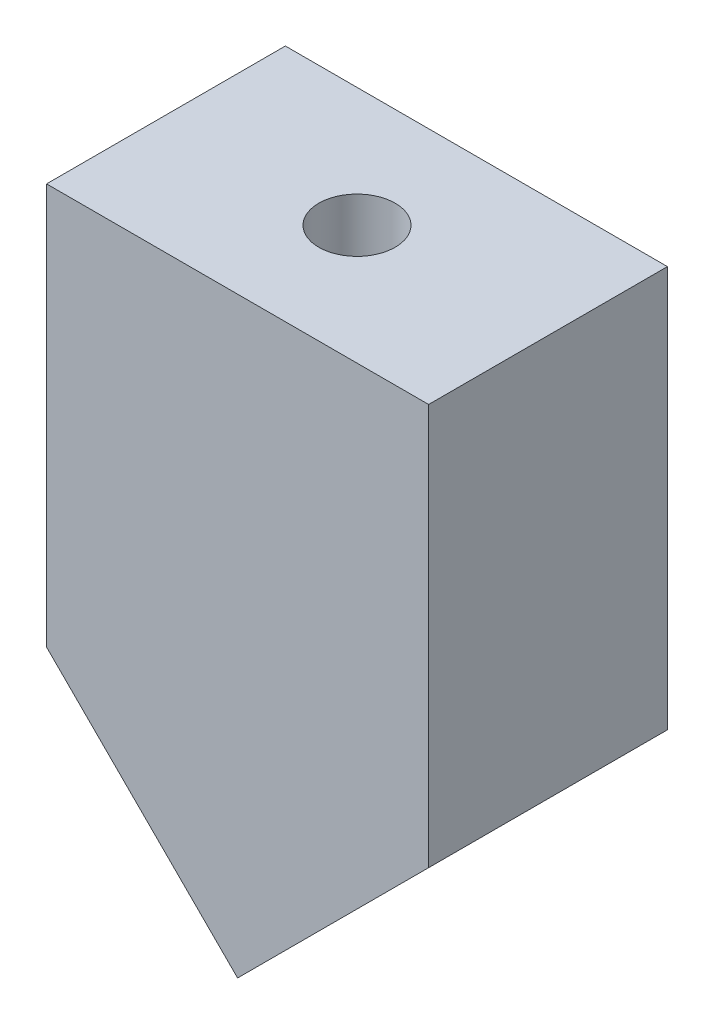
ISO-10303-21;
HEADER;
FILE_DESCRIPTION(('STEP AP214'),'2;1');
FILE_NAME('part.step','',(''),(''),'','','');
FILE_SCHEMA(('AUTOMOTIVE_DESIGN { 1 0 10303 214 1 1 1 1 }'));
ENDSEC;
DATA;
#1=APPLICATION_CONTEXT('core data for automotive mechanical design processes');
#2=APPLICATION_PROTOCOL_DEFINITION('international standard','automotive_design',2000,#1);
#3=PRODUCT_CONTEXT('',#1,'mechanical');
#4=PRODUCT('Part','Part','',(#3));
#5=PRODUCT_RELATED_PRODUCT_CATEGORY('part','',(#4));
#6=PRODUCT_DEFINITION_FORMATION('','',#4);
#7=PRODUCT_DEFINITION_CONTEXT('part definition',#1,'design');
#8=PRODUCT_DEFINITION('design','',#6,#7);
#9=PRODUCT_DEFINITION_SHAPE('','',#8);
#10=(LENGTH_UNIT() NAMED_UNIT(*) SI_UNIT(.MILLI.,.METRE.));
#11=(NAMED_UNIT(*) PLANE_ANGLE_UNIT() SI_UNIT($,.RADIAN.));
#12=(NAMED_UNIT(*) SI_UNIT($,.STERADIAN.) SOLID_ANGLE_UNIT());
#13=UNCERTAINTY_MEASURE_WITH_UNIT(LENGTH_MEASURE(1.E-05),#10,'distance_accuracy_value','');
#14=(GEOMETRIC_REPRESENTATION_CONTEXT(3) GLOBAL_UNCERTAINTY_ASSIGNED_CONTEXT((#13)) GLOBAL_UNIT_ASSIGNED_CONTEXT((#10,
#11,#12)) REPRESENTATION_CONTEXT('',''));
#15=CARTESIAN_POINT('',(0.,0.,0.));
#16=DIRECTION('',(0.,0.,1.));
#17=DIRECTION('',(1.,0.,0.));
#18=AXIS2_PLACEMENT_3D('',#15,#16,#17);
#19=CARTESIAN_POINT('',(-20.,-31.,25.));
#20=DIRECTION('',(1.,0.,0.));
#21=DIRECTION('',(0.,0.,-1.));
#22=AXIS2_PLACEMENT_3D('',#19,#20,#21);
#23=PLANE('',#22);
#24=DIRECTION('',(0.,-1.,0.));
#25=VECTOR('',#24,1.);
#26=CARTESIAN_POINT('',(-20.,-31.,0.));
#27=LINE('',#26,#25);
#28=CARTESIAN_POINT('',(-20.,31.,0.));
#29=VERTEX_POINT('',#28);
#30=CARTESIAN_POINT('',(-20.,-11.0000000000001,0.));
#31=VERTEX_POINT('',#30);
#32=EDGE_CURVE('E81',#29,#31,#27,.T.);
#33=ORIENTED_EDGE('',*,*,#32,.T.);
#34=DIRECTION('',(0.,0.,1.));
#35=VECTOR('',#34,1.);
#36=CARTESIAN_POINT('',(-20.,-11.0000000000001,0.));
#37=LINE('',#36,#35);
#38=CARTESIAN_POINT('',(-20.,-11.0000000000001,25.));
#39=VERTEX_POINT('',#38);
#40=EDGE_CURVE('E47',#31,#39,#37,.T.);
#41=ORIENTED_EDGE('',*,*,#40,.T.);
#42=DIRECTION('',(0.,-1.,0.));
#43=VECTOR('',#42,1.);
#44=CARTESIAN_POINT('',(-20.,-31.,25.));
#45=LINE('',#44,#43);
#46=CARTESIAN_POINT('',(-20.,31.,25.));
#47=VERTEX_POINT('',#46);
#48=EDGE_CURVE('E76',#47,#39,#45,.T.);
#49=ORIENTED_EDGE('',*,*,#48,.F.);
#50=DIRECTION('',(0.,0.,-1.));
#51=VECTOR('',#50,1.);
#52=CARTESIAN_POINT('',(-20.,31.,25.));
#53=LINE('',#52,#51);
#54=EDGE_CURVE('E40',#47,#29,#53,.T.);
#55=ORIENTED_EDGE('',*,*,#54,.T.);
#56=EDGE_LOOP('',(#33,#41,#49,#55));
#57=FACE_BOUND('',#56,.T.);
#58=ADVANCED_FACE('F33',(#57),#23,.F.);
#59=CARTESIAN_POINT('',(20.,-31.,25.));
#60=DIRECTION('',(-1.,0.,0.));
#61=DIRECTION('',(0.,0.,1.));
#62=AXIS2_PLACEMENT_3D('',#59,#60,#61);
#63=PLANE('',#62);
#64=DIRECTION('',(0.,1.,0.));
#65=VECTOR('',#64,1.);
#66=CARTESIAN_POINT('',(20.,-31.,25.));
#67=LINE('',#66,#65);
#68=CARTESIAN_POINT('',(20.,-11.0000000000001,25.));
#69=VERTEX_POINT('',#68);
#70=CARTESIAN_POINT('',(20.,31.,25.));
#71=VERTEX_POINT('',#70);
#72=EDGE_CURVE('E92',#69,#71,#67,.T.);
#73=ORIENTED_EDGE('',*,*,#72,.F.);
#74=DIRECTION('',(0.,0.,1.));
#75=VECTOR('',#74,1.);
#76=CARTESIAN_POINT('',(20.,-11.0000000000001,0.));
#77=LINE('',#76,#75);
#78=CARTESIAN_POINT('',(20.,-11.0000000000001,0.));
#79=VERTEX_POINT('',#78);
#80=EDGE_CURVE('E85',#79,#69,#77,.T.);
#81=ORIENTED_EDGE('',*,*,#80,.F.);
#82=DIRECTION('',(0.,1.,0.));
#83=VECTOR('',#82,1.);
#84=CARTESIAN_POINT('',(20.,-31.,0.));
#85=LINE('',#84,#83);
#86=CARTESIAN_POINT('',(20.,31.,0.));
#87=VERTEX_POINT('',#86);
#88=EDGE_CURVE('E77',#79,#87,#85,.T.);
#89=ORIENTED_EDGE('',*,*,#88,.T.);
#90=DIRECTION('',(0.,0.,-1.));
#91=VECTOR('',#90,1.);
#92=CARTESIAN_POINT('',(20.,31.,25.));
#93=LINE('',#92,#91);
#94=EDGE_CURVE('E11',#71,#87,#93,.T.);
#95=ORIENTED_EDGE('',*,*,#94,.F.);
#96=EDGE_LOOP('',(#73,#81,#89,#95));
#97=FACE_BOUND('',#96,.T.);
#98=ADVANCED_FACE('F125',(#97),#63,.F.);
#99=CARTESIAN_POINT('',(20.,31.,25.));
#100=DIRECTION('',(0.,-1.,0.));
#101=DIRECTION('',(1.,0.,0.));
#102=AXIS2_PLACEMENT_3D('',#99,#100,#101);
#103=PLANE('',#102);
#104=CARTESIAN_POINT('',(0.,31.,12.5));
#105=DIRECTION('',(0.,1.,0.));
#106=DIRECTION('',(-1.,0.,0.));
#107=AXIS2_PLACEMENT_3D('',#104,#105,#106);
#108=CIRCLE('',#107,4.);
#109=CARTESIAN_POINT('',(-4.,31.,12.5));
#110=VERTEX_POINT('',#109);
#111=EDGE_CURVE('E108',#110,#110,#108,.T.);
#112=ORIENTED_EDGE('',*,*,#111,.F.);
#113=EDGE_LOOP('',(#112));
#114=FACE_BOUND('',#113,.T.);
#115=DIRECTION('',(-1.,0.,0.));
#116=VECTOR('',#115,1.);
#117=CARTESIAN_POINT('',(20.,31.,0.));
#118=LINE('',#117,#116);
#119=EDGE_CURVE('E68',#87,#29,#118,.T.);
#120=ORIENTED_EDGE('',*,*,#119,.T.);
#121=ORIENTED_EDGE('',*,*,#54,.F.);
#122=DIRECTION('',(-1.,0.,0.));
#123=VECTOR('',#122,1.);
#124=CARTESIAN_POINT('',(20.,31.,25.));
#125=LINE('',#124,#123);
#126=EDGE_CURVE('E56',#71,#47,#125,.T.);
#127=ORIENTED_EDGE('',*,*,#126,.F.);
#128=ORIENTED_EDGE('',*,*,#94,.T.);
#129=EDGE_LOOP('',(#120,#121,#127,#128));
#130=FACE_BOUND('',#129,.T.);
#131=ADVANCED_FACE('F70',(#114,#130),#103,.F.);
#132=CARTESIAN_POINT('',(0.,0.,25.));
#133=DIRECTION('',(0.,0.,1.));
#134=DIRECTION('',(1.,0.,0.));
#135=AXIS2_PLACEMENT_3D('',#132,#133,#134);
#136=PLANE('',#135);
#137=DIRECTION('',(-0.707106781186549,-0.707106781186546,0.));
#138=VECTOR('',#137,1.);
#139=CARTESIAN_POINT('',(0.,-31.,25.));
#140=LINE('',#139,#138);
#141=CARTESIAN_POINT('',(0.,-31.,25.));
#142=VERTEX_POINT('',#141);
#143=EDGE_CURVE('E102',#69,#142,#140,.T.);
#144=ORIENTED_EDGE('',*,*,#143,.F.);
#145=ORIENTED_EDGE('',*,*,#72,.T.);
#146=ORIENTED_EDGE('',*,*,#126,.T.);
#147=ORIENTED_EDGE('',*,*,#48,.T.);
#148=DIRECTION('',(-0.707106781186549,0.707106781186546,0.));
#149=VECTOR('',#148,1.);
#150=CARTESIAN_POINT('',(0.,-31.,25.));
#151=LINE('',#150,#149);
#152=EDGE_CURVE('E99',#142,#39,#151,.T.);
#153=ORIENTED_EDGE('',*,*,#152,.F.);
#154=EDGE_LOOP('',(#144,#145,#146,#147,#153));
#155=FACE_BOUND('',#154,.T.);
#156=ADVANCED_FACE('F124',(#155),#136,.T.);
#157=CARTESIAN_POINT('',(0.,0.,0.));
#158=DIRECTION('',(0.,0.,1.));
#159=DIRECTION('',(1.,0.,0.));
#160=AXIS2_PLACEMENT_3D('',#157,#158,#159);
#161=PLANE('',#160);
#162=ORIENTED_EDGE('',*,*,#88,.F.);
#163=DIRECTION('',(-0.707106781186549,-0.707106781186546,0.));
#164=VECTOR('',#163,1.);
#165=CARTESIAN_POINT('',(0.,-31.,0.));
#166=LINE('',#165,#164);
#167=CARTESIAN_POINT('',(0.,-31.,0.));
#168=VERTEX_POINT('',#167);
#169=EDGE_CURVE('E101',#79,#168,#166,.T.);
#170=ORIENTED_EDGE('',*,*,#169,.T.);
#171=DIRECTION('',(-0.707106781186549,0.707106781186546,0.));
#172=VECTOR('',#171,1.);
#173=CARTESIAN_POINT('',(0.,-31.,0.));
#174=LINE('',#173,#172);
#175=EDGE_CURVE('E84',#168,#31,#174,.T.);
#176=ORIENTED_EDGE('',*,*,#175,.T.);
#177=ORIENTED_EDGE('',*,*,#32,.F.);
#178=ORIENTED_EDGE('',*,*,#119,.F.);
#179=EDGE_LOOP('',(#162,#170,#176,#177,#178));
#180=FACE_BOUND('',#179,.T.);
#181=ADVANCED_FACE('F82',(#180),#161,.F.);
#182=CARTESIAN_POINT('',(0.,-31.,0.));
#183=DIRECTION('',(-0.707106781186546,0.707106781186549,0.));
#184=DIRECTION('',(-0.707106781186549,-0.707106781186546,0.));
#185=AXIS2_PLACEMENT_3D('',#182,#183,#184);
#186=PLANE('',#185);
#187=ORIENTED_EDGE('',*,*,#143,.T.);
#188=DIRECTION('',(0.,0.,1.));
#189=VECTOR('',#188,1.);
#190=CARTESIAN_POINT('',(0.,-31.,0.));
#191=LINE('',#190,#189);
#192=EDGE_CURVE('E95',#168,#142,#191,.T.);
#193=ORIENTED_EDGE('',*,*,#192,.F.);
#194=ORIENTED_EDGE('',*,*,#169,.F.);
#195=ORIENTED_EDGE('',*,*,#80,.T.);
#196=EDGE_LOOP('',(#187,#193,#194,#195));
#197=FACE_BOUND('',#196,.T.);
#198=ADVANCED_FACE('F157',(#197),#186,.F.);
#199=CARTESIAN_POINT('',(0.,-31.,0.));
#200=DIRECTION('',(0.707106781186547,0.707106781186549,0.));
#201=DIRECTION('',(-0.707106781186549,0.707106781186547,0.));
#202=AXIS2_PLACEMENT_3D('',#199,#200,#201);
#203=PLANE('',#202);
#204=ORIENTED_EDGE('',*,*,#152,.T.);
#205=ORIENTED_EDGE('',*,*,#40,.F.);
#206=ORIENTED_EDGE('',*,*,#175,.F.);
#207=ORIENTED_EDGE('',*,*,#192,.T.);
#208=EDGE_LOOP('',(#204,#205,#206,#207));
#209=FACE_BOUND('',#208,.T.);
#210=ADVANCED_FACE('F119',(#209),#203,.F.);
#211=CARTESIAN_POINT('',(0.,1.00000000000001,12.5));
#212=DIRECTION('',(0.,1.,0.));
#213=DIRECTION('',(-1.,0.,0.));
#214=AXIS2_PLACEMENT_3D('',#211,#212,#213);
#215=CYLINDRICAL_SURFACE('',#214,4.);
#216=CARTESIAN_POINT('',(0.,1.00000000000001,12.5));
#217=DIRECTION('',(0.,1.,0.));
#218=DIRECTION('',(-1.,0.,0.));
#219=AXIS2_PLACEMENT_3D('',#216,#217,#218);
#220=CIRCLE('',#219,4.);
#221=CARTESIAN_POINT('',(-4.,1.00000000000001,12.5));
#222=VERTEX_POINT('',#221);
#223=EDGE_CURVE('E105',#222,#222,#220,.T.);
#224=ORIENTED_EDGE('',*,*,#223,.F.);
#225=EDGE_LOOP('',(#224));
#226=FACE_BOUND('',#225,.T.);
#227=ORIENTED_EDGE('',*,*,#111,.T.);
#228=EDGE_LOOP('',(#227));
#229=FACE_BOUND('',#228,.T.);
#230=ADVANCED_FACE('F116',(#226,#229),#215,.F.);
#231=CARTESIAN_POINT('',(0.,1.00000000000001,12.5));
#232=DIRECTION('',(0.,1.,0.));
#233=DIRECTION('',(-1.,0.,0.));
#234=AXIS2_PLACEMENT_3D('',#231,#232,#233);
#235=PLANE('',#234);
#236=ORIENTED_EDGE('',*,*,#223,.T.);
#237=EDGE_LOOP('',(#236));
#238=FACE_BOUND('',#237,.T.);
#239=ADVANCED_FACE('F114',(#238),#235,.T.);
#240=CLOSED_SHELL('',(#58,#98,#131,#156,#181,#198,#210,#230,#239));
#241=MANIFOLD_SOLID_BREP('B2',#240);
#242=ADVANCED_BREP_SHAPE_REPRESENTATION('',(#18,#241),#14);
#243=SHAPE_DEFINITION_REPRESENTATION(#9,#242);
ENDSEC;
END-ISO-10303-21;
